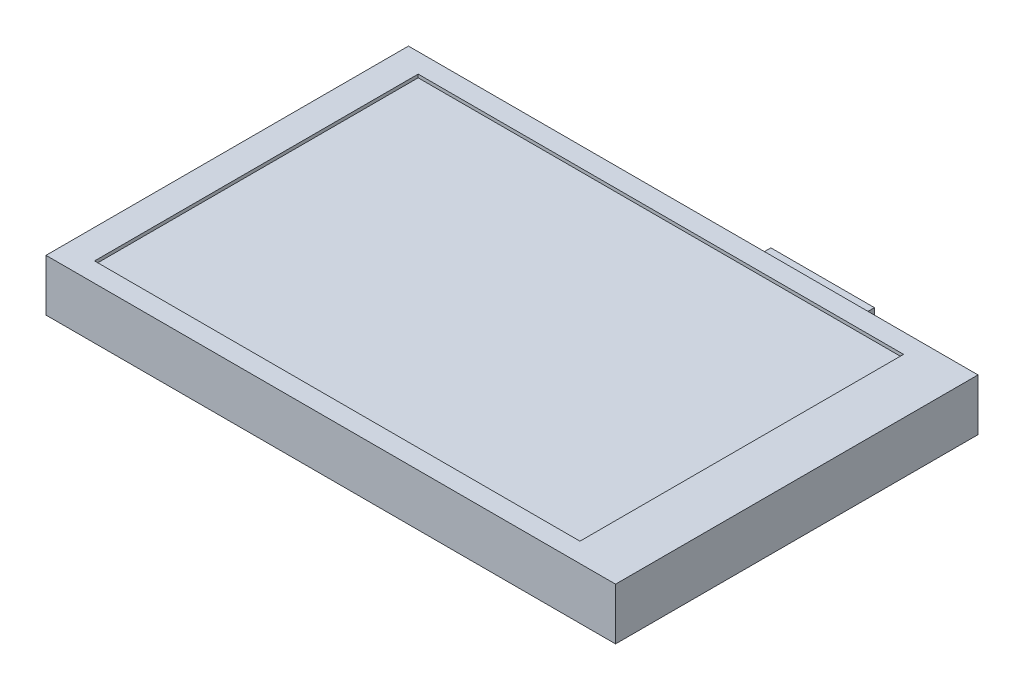
ISO-10303-21;
HEADER;
FILE_DESCRIPTION(('STEP AP214'),'2;1');
FILE_NAME('part.step','',(''),(''),'','','');
FILE_SCHEMA(('AUTOMOTIVE_DESIGN { 1 0 10303 214 1 1 1 1 }'));
ENDSEC;
DATA;
#1=APPLICATION_CONTEXT('core data for automotive mechanical design processes');
#2=APPLICATION_PROTOCOL_DEFINITION('international standard','automotive_design',2000,#1);
#3=PRODUCT_CONTEXT('',#1,'mechanical');
#4=PRODUCT('Part','Part','',(#3));
#5=PRODUCT_RELATED_PRODUCT_CATEGORY('part','',(#4));
#6=PRODUCT_DEFINITION_FORMATION('','',#4);
#7=PRODUCT_DEFINITION_CONTEXT('part definition',#1,'design');
#8=PRODUCT_DEFINITION('design','',#6,#7);
#9=PRODUCT_DEFINITION_SHAPE('','',#8);
#10=(LENGTH_UNIT() NAMED_UNIT(*) SI_UNIT(.MILLI.,.METRE.));
#11=(NAMED_UNIT(*) PLANE_ANGLE_UNIT() SI_UNIT($,.RADIAN.));
#12=(NAMED_UNIT(*) SI_UNIT($,.STERADIAN.) SOLID_ANGLE_UNIT());
#13=UNCERTAINTY_MEASURE_WITH_UNIT(LENGTH_MEASURE(1.E-05),#10,'distance_accuracy_value','');
#14=(GEOMETRIC_REPRESENTATION_CONTEXT(3) GLOBAL_UNCERTAINTY_ASSIGNED_CONTEXT((#13)) GLOBAL_UNIT_ASSIGNED_CONTEXT((#10,
#11,#12)) REPRESENTATION_CONTEXT('',''));
#15=CARTESIAN_POINT('',(0.,0.,0.));
#16=DIRECTION('',(0.,0.,1.));
#17=DIRECTION('',(1.,0.,0.));
#18=AXIS2_PLACEMENT_3D('',#15,#16,#17);
#19=CARTESIAN_POINT('',(3.,-12.,-37.));
#20=DIRECTION('',(-1.,0.,0.));
#21=DIRECTION('',(0.,0.,1.));
#22=AXIS2_PLACEMENT_3D('',#19,#20,#21);
#23=PLANE('',#22);
#24=DIRECTION('',(0.,0.,1.));
#25=VECTOR('',#24,1.);
#26=CARTESIAN_POINT('',(3.,0.,-37.));
#27=LINE('',#26,#25);
#28=CARTESIAN_POINT('',(3.,0.,-37.));
#29=VERTEX_POINT('',#28);
#30=CARTESIAN_POINT('',(3.,0.,-28.));
#31=VERTEX_POINT('',#30);
#32=EDGE_CURVE('E113',#29,#31,#27,.T.);
#33=ORIENTED_EDGE('',*,*,#32,.F.);
#34=DIRECTION('',(0.,1.,0.));
#35=VECTOR('',#34,1.);
#36=CARTESIAN_POINT('',(3.,-12.,-37.));
#37=LINE('',#36,#35);
#38=CARTESIAN_POINT('',(3.,-12.,-37.));
#39=VERTEX_POINT('',#38);
#40=EDGE_CURVE('E12',#39,#29,#37,.T.);
#41=ORIENTED_EDGE('',*,*,#40,.F.);
#42=DIRECTION('',(0.,0.,1.));
#43=VECTOR('',#42,1.);
#44=CARTESIAN_POINT('',(3.,-12.,-37.));
#45=LINE('',#44,#43);
#46=CARTESIAN_POINT('',(3.,-12.,-28.));
#47=VERTEX_POINT('',#46);
#48=EDGE_CURVE('E107',#39,#47,#45,.T.);
#49=ORIENTED_EDGE('',*,*,#48,.T.);
#50=DIRECTION('',(0.,1.,0.));
#51=VECTOR('',#50,1.);
#52=CARTESIAN_POINT('',(3.,-12.,-28.));
#53=LINE('',#52,#51);
#54=EDGE_CURVE('E52',#47,#31,#53,.T.);
#55=ORIENTED_EDGE('',*,*,#54,.T.);
#56=EDGE_LOOP('',(#33,#41,#49,#55));
#57=FACE_BOUND('',#56,.T.);
#58=ADVANCED_FACE('F49',(#57),#23,.T.);
#59=CARTESIAN_POINT('',(3.,-12.,-37.));
#60=DIRECTION('',(0.,0.,-1.));
#61=DIRECTION('',(-1.,0.,0.));
#62=AXIS2_PLACEMENT_3D('',#59,#60,#61);
#63=PLANE('',#62);
#64=DIRECTION('',(-1.,0.,0.));
#65=VECTOR('',#64,1.);
#66=CARTESIAN_POINT('',(3.,0.,-37.));
#67=LINE('',#66,#65);
#68=CARTESIAN_POINT('',(19.,0.,-37.));
#69=VERTEX_POINT('',#68);
#70=EDGE_CURVE('E109',#69,#29,#67,.T.);
#71=ORIENTED_EDGE('',*,*,#70,.F.);
#72=DIRECTION('',(0.,1.,0.));
#73=VECTOR('',#72,1.);
#74=CARTESIAN_POINT('',(19.,-12.,-37.));
#75=LINE('',#74,#73);
#76=CARTESIAN_POINT('',(19.,-12.,-37.));
#77=VERTEX_POINT('',#76);
#78=EDGE_CURVE('E58',#77,#69,#75,.T.);
#79=ORIENTED_EDGE('',*,*,#78,.F.);
#80=DIRECTION('',(-1.,0.,0.));
#81=VECTOR('',#80,1.);
#82=CARTESIAN_POINT('',(3.,-12.,-37.));
#83=LINE('',#82,#81);
#84=EDGE_CURVE('E104',#77,#39,#83,.T.);
#85=ORIENTED_EDGE('',*,*,#84,.T.);
#86=ORIENTED_EDGE('',*,*,#40,.T.);
#87=EDGE_LOOP('',(#71,#79,#85,#86));
#88=FACE_BOUND('',#87,.T.);
#89=ADVANCED_FACE('F123',(#88),#63,.T.);
#90=CARTESIAN_POINT('',(19.,-12.,-37.));
#91=DIRECTION('',(1.,0.,0.));
#92=DIRECTION('',(0.,0.,-1.));
#93=AXIS2_PLACEMENT_3D('',#90,#91,#92);
#94=PLANE('',#93);
#95=DIRECTION('',(0.,0.,-1.));
#96=VECTOR('',#95,1.);
#97=CARTESIAN_POINT('',(19.,0.,-37.));
#98=LINE('',#97,#96);
#99=CARTESIAN_POINT('',(19.,0.,-28.));
#100=VERTEX_POINT('',#99);
#101=EDGE_CURVE('E99',#100,#69,#98,.T.);
#102=ORIENTED_EDGE('',*,*,#101,.F.);
#103=DIRECTION('',(0.,1.,0.));
#104=VECTOR('',#103,1.);
#105=CARTESIAN_POINT('',(19.,-12.,-28.));
#106=LINE('',#105,#104);
#107=CARTESIAN_POINT('',(19.,-12.,-28.));
#108=VERTEX_POINT('',#107);
#109=EDGE_CURVE('E94',#108,#100,#106,.T.);
#110=ORIENTED_EDGE('',*,*,#109,.F.);
#111=DIRECTION('',(0.,0.,-1.));
#112=VECTOR('',#111,1.);
#113=CARTESIAN_POINT('',(19.,-12.,-37.));
#114=LINE('',#113,#112);
#115=EDGE_CURVE('E97',#108,#77,#114,.T.);
#116=ORIENTED_EDGE('',*,*,#115,.T.);
#117=ORIENTED_EDGE('',*,*,#78,.T.);
#118=EDGE_LOOP('',(#102,#110,#116,#117));
#119=FACE_BOUND('',#118,.T.);
#120=ADVANCED_FACE('F96',(#119),#94,.T.);
#121=CARTESIAN_POINT('',(3.,-12.,-28.));
#122=DIRECTION('',(0.,0.,1.));
#123=DIRECTION('',(1.,0.,0.));
#124=AXIS2_PLACEMENT_3D('',#121,#122,#123);
#125=PLANE('',#124);
#126=DIRECTION('',(1.,0.,0.));
#127=VECTOR('',#126,1.);
#128=CARTESIAN_POINT('',(3.,0.,-28.));
#129=LINE('',#128,#127);
#130=EDGE_CURVE('E116',#31,#100,#129,.T.);
#131=ORIENTED_EDGE('',*,*,#130,.F.);
#132=ORIENTED_EDGE('',*,*,#54,.F.);
#133=DIRECTION('',(1.,0.,0.));
#134=VECTOR('',#133,1.);
#135=CARTESIAN_POINT('',(3.,-12.,-28.));
#136=LINE('',#135,#134);
#137=EDGE_CURVE('E103',#47,#108,#136,.T.);
#138=ORIENTED_EDGE('',*,*,#137,.T.);
#139=ORIENTED_EDGE('',*,*,#109,.T.);
#140=EDGE_LOOP('',(#131,#132,#138,#139));
#141=FACE_BOUND('',#140,.T.);
#142=ADVANCED_FACE('F106',(#141),#125,.T.);
#143=CARTESIAN_POINT('',(0.,-12.,0.));
#144=DIRECTION('',(0.,1.,0.));
#145=DIRECTION('',(0.,0.,1.));
#146=AXIS2_PLACEMENT_3D('',#143,#144,#145);
#147=PLANE('',#146);
#148=ORIENTED_EDGE('',*,*,#48,.F.);
#149=ORIENTED_EDGE('',*,*,#84,.F.);
#150=ORIENTED_EDGE('',*,*,#115,.F.);
#151=ORIENTED_EDGE('',*,*,#137,.F.);
#152=EDGE_LOOP('',(#148,#149,#150,#151));
#153=FACE_BOUND('',#152,.T.);
#154=ADVANCED_FACE('F102',(#153),#147,.F.);
#155=CARTESIAN_POINT('',(0.,0.,0.));
#156=DIRECTION('',(0.,1.,0.));
#157=DIRECTION('',(0.,0.,1.));
#158=AXIS2_PLACEMENT_3D('',#155,#156,#157);
#159=PLANE('',#158);
#160=ORIENTED_EDGE('',*,*,#32,.T.);
#161=ORIENTED_EDGE('',*,*,#130,.T.);
#162=ORIENTED_EDGE('',*,*,#101,.T.);
#163=ORIENTED_EDGE('',*,*,#70,.T.);
#164=EDGE_LOOP('',(#160,#161,#162,#163));
#165=FACE_BOUND('',#164,.T.);
#166=ADVANCED_FACE('F122',(#165),#159,.T.);
#167=CLOSED_SHELL('',(#58,#89,#120,#142,#154,#166));
#168=MANIFOLD_SOLID_BREP('B2',#167);
#169=CARTESIAN_POINT('',(-44.,8.,-28.));
#170=DIRECTION('',(1.,0.,0.));
#171=DIRECTION('',(0.,0.,-1.));
#172=AXIS2_PLACEMENT_3D('',#169,#170,#171);
#173=PLANE('',#172);
#174=DIRECTION('',(0.,0.,1.));
#175=VECTOR('',#174,1.);
#176=CARTESIAN_POINT('',(-44.,0.,-28.));
#177=LINE('',#176,#175);
#178=CARTESIAN_POINT('',(-44.,0.,-28.));
#179=VERTEX_POINT('',#178);
#180=CARTESIAN_POINT('',(-44.,0.,28.));
#181=VERTEX_POINT('',#180);
#182=EDGE_CURVE('E292',#179,#181,#177,.T.);
#183=ORIENTED_EDGE('',*,*,#182,.T.);
#184=DIRECTION('',(0.,-1.,0.));
#185=VECTOR('',#184,1.);
#186=CARTESIAN_POINT('',(-44.,8.,28.));
#187=LINE('',#186,#185);
#188=CARTESIAN_POINT('',(-44.,8.,28.));
#189=VERTEX_POINT('',#188);
#190=EDGE_CURVE('E47',#189,#181,#187,.T.);
#191=ORIENTED_EDGE('',*,*,#190,.F.);
#192=DIRECTION('',(0.,0.,1.));
#193=VECTOR('',#192,1.);
#194=CARTESIAN_POINT('',(-44.,8.,-28.));
#195=LINE('',#194,#193);
#196=CARTESIAN_POINT('',(-44.,8.,-28.));
#197=VERTEX_POINT('',#196);
#198=EDGE_CURVE('E298',#197,#189,#195,.T.);
#199=ORIENTED_EDGE('',*,*,#198,.F.);
#200=DIRECTION('',(0.,-1.,0.));
#201=VECTOR('',#200,1.);
#202=CARTESIAN_POINT('',(-44.,8.,-28.));
#203=LINE('',#202,#201);
#204=EDGE_CURVE('E308',#197,#179,#203,.T.);
#205=ORIENTED_EDGE('',*,*,#204,.T.);
#206=EDGE_LOOP('',(#183,#191,#199,#205));
#207=FACE_BOUND('',#206,.T.);
#208=ADVANCED_FACE('F173',(#207),#173,.F.);
#209=CARTESIAN_POINT('',(-44.,8.,28.));
#210=DIRECTION('',(0.,0.,-1.));
#211=DIRECTION('',(-1.,0.,0.));
#212=AXIS2_PLACEMENT_3D('',#209,#210,#211);
#213=PLANE('',#212);
#214=DIRECTION('',(1.,0.,0.));
#215=VECTOR('',#214,1.);
#216=CARTESIAN_POINT('',(-44.,0.,28.));
#217=LINE('',#216,#215);
#218=CARTESIAN_POINT('',(44.,0.,28.));
#219=VERTEX_POINT('',#218);
#220=EDGE_CURVE('E312',#181,#219,#217,.T.);
#221=ORIENTED_EDGE('',*,*,#220,.T.);
#222=DIRECTION('',(0.,-1.,0.));
#223=VECTOR('',#222,1.);
#224=CARTESIAN_POINT('',(44.,8.,28.));
#225=LINE('',#224,#223);
#226=CARTESIAN_POINT('',(44.,8.,28.));
#227=VERTEX_POINT('',#226);
#228=EDGE_CURVE('E181',#227,#219,#225,.T.);
#229=ORIENTED_EDGE('',*,*,#228,.F.);
#230=DIRECTION('',(1.,0.,0.));
#231=VECTOR('',#230,1.);
#232=CARTESIAN_POINT('',(-44.,8.,28.));
#233=LINE('',#232,#231);
#234=EDGE_CURVE('E225',#189,#227,#233,.T.);
#235=ORIENTED_EDGE('',*,*,#234,.F.);
#236=ORIENTED_EDGE('',*,*,#190,.T.);
#237=EDGE_LOOP('',(#221,#229,#235,#236));
#238=FACE_BOUND('',#237,.T.);
#239=ADVANCED_FACE('F347',(#238),#213,.F.);
#240=CARTESIAN_POINT('',(44.,8.,-28.));
#241=DIRECTION('',(-1.,0.,0.));
#242=DIRECTION('',(0.,0.,1.));
#243=AXIS2_PLACEMENT_3D('',#240,#241,#242);
#244=PLANE('',#243);
#245=DIRECTION('',(0.,0.,-1.));
#246=VECTOR('',#245,1.);
#247=CARTESIAN_POINT('',(44.,0.,-28.));
#248=LINE('',#247,#246);
#249=CARTESIAN_POINT('',(44.,0.,-28.));
#250=VERTEX_POINT('',#249);
#251=EDGE_CURVE('E315',#219,#250,#248,.T.);
#252=ORIENTED_EDGE('',*,*,#251,.T.);
#253=DIRECTION('',(0.,-1.,0.));
#254=VECTOR('',#253,1.);
#255=CARTESIAN_POINT('',(44.,8.,-28.));
#256=LINE('',#255,#254);
#257=CARTESIAN_POINT('',(44.,8.,-28.));
#258=VERTEX_POINT('',#257);
#259=EDGE_CURVE('E322',#258,#250,#256,.T.);
#260=ORIENTED_EDGE('',*,*,#259,.F.);
#261=DIRECTION('',(0.,0.,-1.));
#262=VECTOR('',#261,1.);
#263=CARTESIAN_POINT('',(44.,8.,-28.));
#264=LINE('',#263,#262);
#265=EDGE_CURVE('E303',#227,#258,#264,.T.);
#266=ORIENTED_EDGE('',*,*,#265,.F.);
#267=ORIENTED_EDGE('',*,*,#228,.T.);
#268=EDGE_LOOP('',(#252,#260,#266,#267));
#269=FACE_BOUND('',#268,.T.);
#270=ADVANCED_FACE('F329',(#269),#244,.F.);
#271=CARTESIAN_POINT('',(-44.,8.,-28.));
#272=DIRECTION('',(0.,0.,1.));
#273=DIRECTION('',(1.,0.,0.));
#274=AXIS2_PLACEMENT_3D('',#271,#272,#273);
#275=PLANE('',#274);
#276=DIRECTION('',(-1.,0.,0.));
#277=VECTOR('',#276,1.);
#278=CARTESIAN_POINT('',(-44.,0.,-28.));
#279=LINE('',#278,#277);
#280=EDGE_CURVE('E218',#250,#179,#279,.T.);
#281=ORIENTED_EDGE('',*,*,#280,.T.);
#282=ORIENTED_EDGE('',*,*,#204,.F.);
#283=DIRECTION('',(-1.,0.,0.));
#284=VECTOR('',#283,1.);
#285=CARTESIAN_POINT('',(-44.,8.,-28.));
#286=LINE('',#285,#284);
#287=EDGE_CURVE('E197',#258,#197,#286,.T.);
#288=ORIENTED_EDGE('',*,*,#287,.F.);
#289=ORIENTED_EDGE('',*,*,#259,.T.);
#290=EDGE_LOOP('',(#281,#282,#288,#289));
#291=FACE_BOUND('',#290,.T.);
#292=ADVANCED_FACE('F337',(#291),#275,.F.);
#293=CARTESIAN_POINT('',(0.,8.,0.));
#294=DIRECTION('',(0.,1.,0.));
#295=DIRECTION('',(0.,0.,1.));
#296=AXIS2_PLACEMENT_3D('',#293,#294,#295);
#297=PLANE('',#296);
#298=DIRECTION('',(0.,0.,1.));
#299=VECTOR('',#298,1.);
#300=CARTESIAN_POINT('',(-39.5,8.,-25.));
#301=LINE('',#300,#299);
#302=CARTESIAN_POINT('',(-39.5,8.,-25.));
#303=VERTEX_POINT('',#302);
#304=CARTESIAN_POINT('',(-39.5,8.,25.));
#305=VERTEX_POINT('',#304);
#306=EDGE_CURVE('E188',#303,#305,#301,.T.);
#307=ORIENTED_EDGE('',*,*,#306,.F.);
#308=DIRECTION('',(-1.,0.,0.));
#309=VECTOR('',#308,1.);
#310=CARTESIAN_POINT('',(-39.5,8.,-25.));
#311=LINE('',#310,#309);
#312=CARTESIAN_POINT('',(35.5,8.,-25.));
#313=VERTEX_POINT('',#312);
#314=EDGE_CURVE('E270',#313,#303,#311,.T.);
#315=ORIENTED_EDGE('',*,*,#314,.F.);
#316=DIRECTION('',(0.,0.,-1.));
#317=VECTOR('',#316,1.);
#318=CARTESIAN_POINT('',(35.5,8.,-25.));
#319=LINE('',#318,#317);
#320=CARTESIAN_POINT('',(35.5,8.,25.));
#321=VERTEX_POINT('',#320);
#322=EDGE_CURVE('E274',#321,#313,#319,.T.);
#323=ORIENTED_EDGE('',*,*,#322,.F.);
#324=DIRECTION('',(1.,0.,0.));
#325=VECTOR('',#324,1.);
#326=CARTESIAN_POINT('',(-39.5,8.,25.));
#327=LINE('',#326,#325);
#328=EDGE_CURVE('E283',#305,#321,#327,.T.);
#329=ORIENTED_EDGE('',*,*,#328,.F.);
#330=EDGE_LOOP('',(#307,#315,#323,#329));
#331=FACE_BOUND('',#330,.T.);
#332=ORIENTED_EDGE('',*,*,#198,.T.);
#333=ORIENTED_EDGE('',*,*,#234,.T.);
#334=ORIENTED_EDGE('',*,*,#265,.T.);
#335=ORIENTED_EDGE('',*,*,#287,.T.);
#336=EDGE_LOOP('',(#332,#333,#334,#335));
#337=FACE_BOUND('',#336,.T.);
#338=ADVANCED_FACE('F339',(#331,#337),#297,.T.);
#339=CARTESIAN_POINT('',(0.,0.,0.));
#340=DIRECTION('',(0.,1.,0.));
#341=DIRECTION('',(0.,0.,1.));
#342=AXIS2_PLACEMENT_3D('',#339,#340,#341);
#343=PLANE('',#342);
#344=ORIENTED_EDGE('',*,*,#182,.F.);
#345=ORIENTED_EDGE('',*,*,#280,.F.);
#346=ORIENTED_EDGE('',*,*,#251,.F.);
#347=ORIENTED_EDGE('',*,*,#220,.F.);
#348=EDGE_LOOP('',(#344,#345,#346,#347));
#349=FACE_BOUND('',#348,.T.);
#350=ADVANCED_FACE('F333',(#349),#343,.F.);
#351=CARTESIAN_POINT('',(-39.5,7.5,-25.));
#352=DIRECTION('',(-1.,0.,0.));
#353=DIRECTION('',(0.,0.,1.));
#354=AXIS2_PLACEMENT_3D('',#351,#352,#353);
#355=PLANE('',#354);
#356=ORIENTED_EDGE('',*,*,#306,.T.);
#357=DIRECTION('',(0.,1.,0.));
#358=VECTOR('',#357,1.);
#359=CARTESIAN_POINT('',(-39.5,7.5,25.));
#360=LINE('',#359,#358);
#361=CARTESIAN_POINT('',(-39.5,7.5,25.));
#362=VERTEX_POINT('',#361);
#363=EDGE_CURVE('E245',#362,#305,#360,.T.);
#364=ORIENTED_EDGE('',*,*,#363,.F.);
#365=DIRECTION('',(0.,0.,1.));
#366=VECTOR('',#365,1.);
#367=CARTESIAN_POINT('',(-39.5,7.5,-25.));
#368=LINE('',#367,#366);
#369=CARTESIAN_POINT('',(-39.5,7.5,-25.));
#370=VERTEX_POINT('',#369);
#371=EDGE_CURVE('E249',#370,#362,#368,.T.);
#372=ORIENTED_EDGE('',*,*,#371,.F.);
#373=DIRECTION('',(0.,1.,0.));
#374=VECTOR('',#373,1.);
#375=CARTESIAN_POINT('',(-39.5,7.5,-25.));
#376=LINE('',#375,#374);
#377=EDGE_CURVE('E289',#370,#303,#376,.T.);
#378=ORIENTED_EDGE('',*,*,#377,.T.);
#379=EDGE_LOOP('',(#356,#364,#372,#378));
#380=FACE_BOUND('',#379,.T.);
#381=ADVANCED_FACE('F247',(#380),#355,.F.);
#382=CARTESIAN_POINT('',(-39.5,7.5,-25.));
#383=DIRECTION('',(0.,0.,-1.));
#384=DIRECTION('',(-1.,0.,0.));
#385=AXIS2_PLACEMENT_3D('',#382,#383,#384);
#386=PLANE('',#385);
#387=ORIENTED_EDGE('',*,*,#314,.T.);
#388=ORIENTED_EDGE('',*,*,#377,.F.);
#389=DIRECTION('',(-1.,0.,0.));
#390=VECTOR('',#389,1.);
#391=CARTESIAN_POINT('',(-39.5,7.5,-25.));
#392=LINE('',#391,#390);
#393=CARTESIAN_POINT('',(35.5,7.5,-25.));
#394=VERTEX_POINT('',#393);
#395=EDGE_CURVE('E256',#394,#370,#392,.T.);
#396=ORIENTED_EDGE('',*,*,#395,.F.);
#397=DIRECTION('',(0.,1.,0.));
#398=VECTOR('',#397,1.);
#399=CARTESIAN_POINT('',(35.5,7.5,-25.));
#400=LINE('',#399,#398);
#401=EDGE_CURVE('E293',#394,#313,#400,.T.);
#402=ORIENTED_EDGE('',*,*,#401,.T.);
#403=EDGE_LOOP('',(#387,#388,#396,#402));
#404=FACE_BOUND('',#403,.T.);
#405=ADVANCED_FACE('F386',(#404),#386,.F.);
#406=CARTESIAN_POINT('',(35.5,7.5,-25.));
#407=DIRECTION('',(1.,0.,0.));
#408=DIRECTION('',(0.,0.,-1.));
#409=AXIS2_PLACEMENT_3D('',#406,#407,#408);
#410=PLANE('',#409);
#411=ORIENTED_EDGE('',*,*,#322,.T.);
#412=ORIENTED_EDGE('',*,*,#401,.F.);
#413=DIRECTION('',(0.,0.,-1.));
#414=VECTOR('',#413,1.);
#415=CARTESIAN_POINT('',(35.5,7.5,-25.));
#416=LINE('',#415,#414);
#417=CARTESIAN_POINT('',(35.5,7.5,25.));
#418=VERTEX_POINT('',#417);
#419=EDGE_CURVE('E265',#418,#394,#416,.T.);
#420=ORIENTED_EDGE('',*,*,#419,.F.);
#421=DIRECTION('',(0.,1.,0.));
#422=VECTOR('',#421,1.);
#423=CARTESIAN_POINT('',(35.5,7.5,25.));
#424=LINE('',#423,#422);
#425=EDGE_CURVE('E255',#418,#321,#424,.T.);
#426=ORIENTED_EDGE('',*,*,#425,.T.);
#427=EDGE_LOOP('',(#411,#412,#420,#426));
#428=FACE_BOUND('',#427,.T.);
#429=ADVANCED_FACE('F395',(#428),#410,.F.);
#430=CARTESIAN_POINT('',(-39.5,7.5,25.));
#431=DIRECTION('',(0.,0.,1.));
#432=DIRECTION('',(1.,0.,0.));
#433=AXIS2_PLACEMENT_3D('',#430,#431,#432);
#434=PLANE('',#433);
#435=ORIENTED_EDGE('',*,*,#328,.T.);
#436=ORIENTED_EDGE('',*,*,#425,.F.);
#437=DIRECTION('',(1.,0.,0.));
#438=VECTOR('',#437,1.);
#439=CARTESIAN_POINT('',(-39.5,7.5,25.));
#440=LINE('',#439,#438);
#441=EDGE_CURVE('E259',#362,#418,#440,.T.);
#442=ORIENTED_EDGE('',*,*,#441,.F.);
#443=ORIENTED_EDGE('',*,*,#363,.T.);
#444=EDGE_LOOP('',(#435,#436,#442,#443));
#445=FACE_BOUND('',#444,.T.);
#446=ADVANCED_FACE('F260',(#445),#434,.F.);
#447=CARTESIAN_POINT('',(0.,7.5,0.));
#448=DIRECTION('',(0.,1.,0.));
#449=DIRECTION('',(0.,0.,1.));
#450=AXIS2_PLACEMENT_3D('',#447,#448,#449);
#451=PLANE('',#450);
#452=ORIENTED_EDGE('',*,*,#371,.T.);
#453=ORIENTED_EDGE('',*,*,#441,.T.);
#454=ORIENTED_EDGE('',*,*,#419,.T.);
#455=ORIENTED_EDGE('',*,*,#395,.T.);
#456=EDGE_LOOP('',(#452,#453,#454,#455));
#457=FACE_BOUND('',#456,.T.);
#458=ADVANCED_FACE('F267',(#457),#451,.T.);
#459=CLOSED_SHELL('',(#208,#239,#270,#292,#338,#350,#381,#405,#429,#446,#458));
#460=MANIFOLD_SOLID_BREP('B6',#459);
#461=ADVANCED_BREP_SHAPE_REPRESENTATION('',(#18,#168,#460),#14);
#462=SHAPE_DEFINITION_REPRESENTATION(#9,#461);
ENDSEC;
END-ISO-10303-21;
